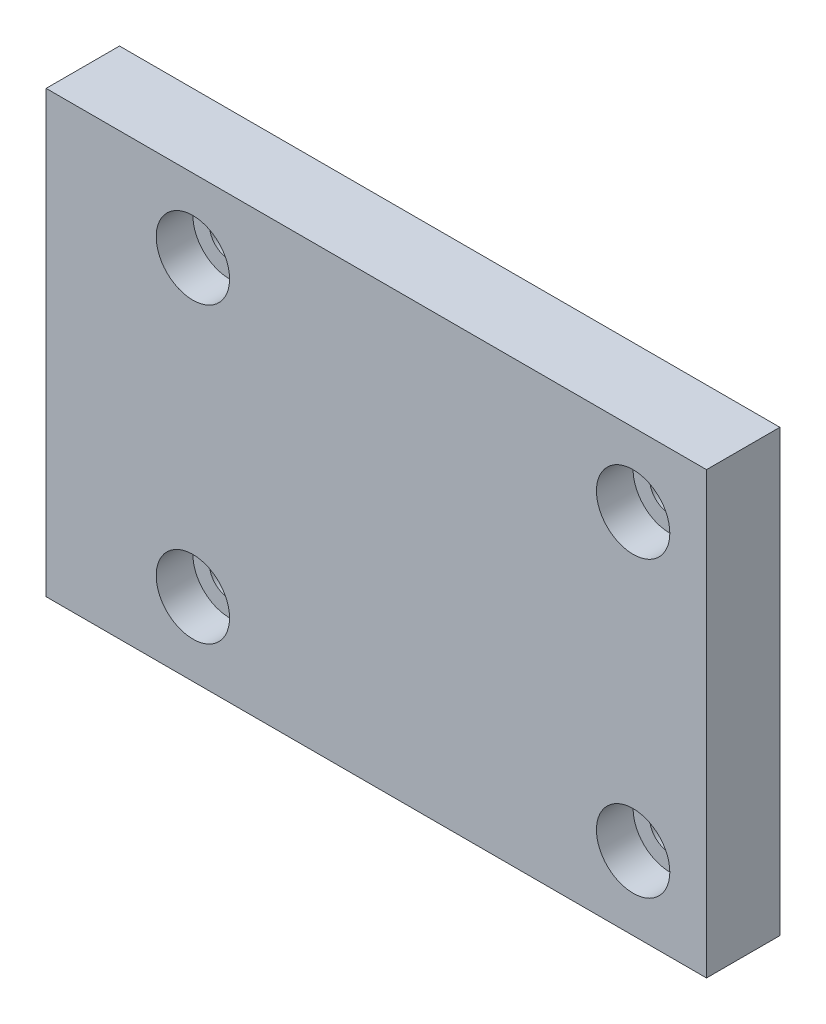
ISO-10303-21;
HEADER;
FILE_DESCRIPTION(('STEP AP214'),'2;1');
FILE_NAME('part.step','',(''),(''),'','','');
FILE_SCHEMA(('AUTOMOTIVE_DESIGN { 1 0 10303 214 1 1 1 1 }'));
ENDSEC;
DATA;
#1=APPLICATION_CONTEXT('core data for automotive mechanical design processes');
#2=APPLICATION_PROTOCOL_DEFINITION('international standard','automotive_design',2000,#1);
#3=PRODUCT_CONTEXT('',#1,'mechanical');
#4=PRODUCT('Part','Part','',(#3));
#5=PRODUCT_RELATED_PRODUCT_CATEGORY('part','',(#4));
#6=PRODUCT_DEFINITION_FORMATION('','',#4);
#7=PRODUCT_DEFINITION_CONTEXT('part definition',#1,'design');
#8=PRODUCT_DEFINITION('design','',#6,#7);
#9=PRODUCT_DEFINITION_SHAPE('','',#8);
#10=(LENGTH_UNIT() NAMED_UNIT(*) SI_UNIT(.MILLI.,.METRE.));
#11=(NAMED_UNIT(*) PLANE_ANGLE_UNIT() SI_UNIT($,.RADIAN.));
#12=(NAMED_UNIT(*) SI_UNIT($,.STERADIAN.) SOLID_ANGLE_UNIT());
#13=UNCERTAINTY_MEASURE_WITH_UNIT(LENGTH_MEASURE(1.E-05),#10,'distance_accuracy_value','');
#14=(GEOMETRIC_REPRESENTATION_CONTEXT(3) GLOBAL_UNCERTAINTY_ASSIGNED_CONTEXT((#13)) GLOBAL_UNIT_ASSIGNED_CONTEXT((#10,
#11,#12)) REPRESENTATION_CONTEXT('',''));
#15=CARTESIAN_POINT('',(0.,0.,0.));
#16=DIRECTION('',(0.,0.,1.));
#17=DIRECTION('',(1.,0.,0.));
#18=AXIS2_PLACEMENT_3D('',#15,#16,#17);
#19=CARTESIAN_POINT('',(35.,-20.,5.));
#20=DIRECTION('',(0.,0.,1.));
#21=DIRECTION('',(1.,0.,0.));
#22=AXIS2_PLACEMENT_3D('',#19,#20,#21);
#23=CYLINDRICAL_SURFACE('',#22,5.);
#24=CARTESIAN_POINT('',(35.,-20.,0.));
#25=DIRECTION('',(0.,0.,1.));
#26=DIRECTION('',(1.,0.,0.));
#27=AXIS2_PLACEMENT_3D('',#24,#25,#26);
#28=CIRCLE('',#27,5.);
#29=CARTESIAN_POINT('',(40.,-20.,0.));
#30=VERTEX_POINT('',#29);
#31=EDGE_CURVE('E11',#30,#30,#28,.T.);
#32=ORIENTED_EDGE('',*,*,#31,.F.);
#33=EDGE_LOOP('',(#32));
#34=FACE_BOUND('',#33,.T.);
#35=CARTESIAN_POINT('',(35.,-20.,5.));
#36=DIRECTION('',(0.,0.,1.));
#37=DIRECTION('',(1.,0.,0.));
#38=AXIS2_PLACEMENT_3D('',#35,#36,#37);
#39=CIRCLE('',#38,5.);
#40=CARTESIAN_POINT('',(40.,-20.,5.));
#41=VERTEX_POINT('',#40);
#42=EDGE_CURVE('E123',#41,#41,#39,.T.);
#43=ORIENTED_EDGE('',*,*,#42,.T.);
#44=EDGE_LOOP('',(#43));
#45=FACE_BOUND('',#44,.T.);
#46=ADVANCED_FACE('F33',(#34,#45),#23,.F.);
#47=CARTESIAN_POINT('',(37.75,-20.,0.));
#48=DIRECTION('',(0.,0.,-1.));
#49=DIRECTION('',(-1.,0.,0.));
#50=AXIS2_PLACEMENT_3D('',#47,#48,#49);
#51=PLANE('',#50);
#52=CARTESIAN_POINT('',(35.,-20.,0.));
#53=DIRECTION('',(0.,0.,1.));
#54=DIRECTION('',(1.,0.,0.));
#55=AXIS2_PLACEMENT_3D('',#52,#53,#54);
#56=CIRCLE('',#55,2.75);
#57=CARTESIAN_POINT('',(37.75,-20.,0.));
#58=VERTEX_POINT('',#57);
#59=EDGE_CURVE('E41',#58,#58,#56,.T.);
#60=ORIENTED_EDGE('',*,*,#59,.F.);
#61=EDGE_LOOP('',(#60));
#62=FACE_BOUND('',#61,.T.);
#63=ORIENTED_EDGE('',*,*,#31,.T.);
#64=EDGE_LOOP('',(#63));
#65=FACE_BOUND('',#64,.T.);
#66=ADVANCED_FACE('F133',(#62,#65),#51,.F.);
#67=CARTESIAN_POINT('',(35.,-20.,5.));
#68=DIRECTION('',(0.,0.,1.));
#69=DIRECTION('',(1.,0.,0.));
#70=AXIS2_PLACEMENT_3D('',#67,#68,#69);
#71=CYLINDRICAL_SURFACE('',#70,2.75);
#72=CARTESIAN_POINT('',(35.,-20.,-5.));
#73=DIRECTION('',(0.,0.,1.));
#74=DIRECTION('',(1.,0.,0.));
#75=AXIS2_PLACEMENT_3D('',#72,#73,#74);
#76=CIRCLE('',#75,2.75);
#77=CARTESIAN_POINT('',(37.75,-20.,-5.));
#78=VERTEX_POINT('',#77);
#79=EDGE_CURVE('E126',#78,#78,#76,.T.);
#80=ORIENTED_EDGE('',*,*,#79,.F.);
#81=EDGE_LOOP('',(#80));
#82=FACE_BOUND('',#81,.T.);
#83=ORIENTED_EDGE('',*,*,#59,.T.);
#84=EDGE_LOOP('',(#83));
#85=FACE_BOUND('',#84,.T.);
#86=ADVANCED_FACE('F131',(#82,#85),#71,.F.);
#87=CARTESIAN_POINT('',(-25.,-20.,5.));
#88=DIRECTION('',(0.,0.,1.));
#89=DIRECTION('',(1.,0.,0.));
#90=AXIS2_PLACEMENT_3D('',#87,#88,#89);
#91=CYLINDRICAL_SURFACE('',#90,5.);
#92=CARTESIAN_POINT('',(-25.,-20.,0.));
#93=DIRECTION('',(0.,0.,1.));
#94=DIRECTION('',(1.,0.,0.));
#95=AXIS2_PLACEMENT_3D('',#92,#93,#94);
#96=CIRCLE('',#95,5.);
#97=CARTESIAN_POINT('',(-20.,-20.,0.));
#98=VERTEX_POINT('',#97);
#99=EDGE_CURVE('E120',#98,#98,#96,.T.);
#100=ORIENTED_EDGE('',*,*,#99,.F.);
#101=EDGE_LOOP('',(#100));
#102=FACE_BOUND('',#101,.T.);
#103=CARTESIAN_POINT('',(-25.,-20.,5.));
#104=DIRECTION('',(0.,0.,1.));
#105=DIRECTION('',(1.,0.,0.));
#106=AXIS2_PLACEMENT_3D('',#103,#104,#105);
#107=CIRCLE('',#106,5.);
#108=CARTESIAN_POINT('',(-20.,-20.,5.));
#109=VERTEX_POINT('',#108);
#110=EDGE_CURVE('E111',#109,#109,#107,.T.);
#111=ORIENTED_EDGE('',*,*,#110,.T.);
#112=EDGE_LOOP('',(#111));
#113=FACE_BOUND('',#112,.T.);
#114=ADVANCED_FACE('F175',(#102,#113),#91,.F.);
#115=CARTESIAN_POINT('',(-22.25,-20.,0.));
#116=DIRECTION('',(0.,0.,-1.));
#117=DIRECTION('',(-1.,0.,0.));
#118=AXIS2_PLACEMENT_3D('',#115,#116,#117);
#119=PLANE('',#118);
#120=CARTESIAN_POINT('',(-25.,-20.,0.));
#121=DIRECTION('',(0.,0.,1.));
#122=DIRECTION('',(1.,0.,0.));
#123=AXIS2_PLACEMENT_3D('',#120,#121,#122);
#124=CIRCLE('',#123,2.75);
#125=CARTESIAN_POINT('',(-22.25,-20.,0.));
#126=VERTEX_POINT('',#125);
#127=EDGE_CURVE('E117',#126,#126,#124,.T.);
#128=ORIENTED_EDGE('',*,*,#127,.F.);
#129=EDGE_LOOP('',(#128));
#130=FACE_BOUND('',#129,.T.);
#131=ORIENTED_EDGE('',*,*,#99,.T.);
#132=EDGE_LOOP('',(#131));
#133=FACE_BOUND('',#132,.T.);
#134=ADVANCED_FACE('F171',(#130,#133),#119,.F.);
#135=CARTESIAN_POINT('',(-25.,-20.,5.));
#136=DIRECTION('',(0.,0.,1.));
#137=DIRECTION('',(1.,0.,0.));
#138=AXIS2_PLACEMENT_3D('',#135,#136,#137);
#139=CYLINDRICAL_SURFACE('',#138,2.75);
#140=CARTESIAN_POINT('',(-25.,-20.,-5.));
#141=DIRECTION('',(0.,0.,1.));
#142=DIRECTION('',(1.,0.,0.));
#143=AXIS2_PLACEMENT_3D('',#140,#141,#142);
#144=CIRCLE('',#143,2.75);
#145=CARTESIAN_POINT('',(-22.25,-20.,-5.));
#146=VERTEX_POINT('',#145);
#147=EDGE_CURVE('E114',#146,#146,#144,.T.);
#148=ORIENTED_EDGE('',*,*,#147,.F.);
#149=EDGE_LOOP('',(#148));
#150=FACE_BOUND('',#149,.T.);
#151=ORIENTED_EDGE('',*,*,#127,.T.);
#152=EDGE_LOOP('',(#151));
#153=FACE_BOUND('',#152,.T.);
#154=ADVANCED_FACE('F167',(#150,#153),#139,.F.);
#155=CARTESIAN_POINT('',(45.,-30.,5.));
#156=DIRECTION('',(-1.,0.,0.));
#157=DIRECTION('',(0.,0.,1.));
#158=AXIS2_PLACEMENT_3D('',#155,#156,#157);
#159=PLANE('',#158);
#160=DIRECTION('',(0.,1.,0.));
#161=VECTOR('',#160,1.);
#162=CARTESIAN_POINT('',(45.,-30.,-5.));
#163=LINE('',#162,#161);
#164=CARTESIAN_POINT('',(45.,-30.,-5.));
#165=VERTEX_POINT('',#164);
#166=CARTESIAN_POINT('',(45.,30.,-5.));
#167=VERTEX_POINT('',#166);
#168=EDGE_CURVE('E101',#165,#167,#163,.T.);
#169=ORIENTED_EDGE('',*,*,#168,.T.);
#170=DIRECTION('',(0.,0.,-1.));
#171=VECTOR('',#170,1.);
#172=CARTESIAN_POINT('',(45.,30.,5.));
#173=LINE('',#172,#171);
#174=CARTESIAN_POINT('',(45.,30.,5.));
#175=VERTEX_POINT('',#174);
#176=EDGE_CURVE('E92',#175,#167,#173,.T.);
#177=ORIENTED_EDGE('',*,*,#176,.F.);
#178=DIRECTION('',(0.,1.,0.));
#179=VECTOR('',#178,1.);
#180=CARTESIAN_POINT('',(45.,-30.,5.));
#181=LINE('',#180,#179);
#182=CARTESIAN_POINT('',(45.,-30.,5.));
#183=VERTEX_POINT('',#182);
#184=EDGE_CURVE('E86',#183,#175,#181,.T.);
#185=ORIENTED_EDGE('',*,*,#184,.F.);
#186=DIRECTION('',(0.,0.,-1.));
#187=VECTOR('',#186,1.);
#188=CARTESIAN_POINT('',(45.,-30.,5.));
#189=LINE('',#188,#187);
#190=EDGE_CURVE('E97',#183,#165,#189,.T.);
#191=ORIENTED_EDGE('',*,*,#190,.T.);
#192=EDGE_LOOP('',(#169,#177,#185,#191));
#193=FACE_BOUND('',#192,.T.);
#194=ADVANCED_FACE('F164',(#193),#159,.F.);
#195=CARTESIAN_POINT('',(-45.,30.,5.));
#196=DIRECTION('',(0.,-1.,0.));
#197=DIRECTION('',(0.,0.,-1.));
#198=AXIS2_PLACEMENT_3D('',#195,#196,#197);
#199=PLANE('',#198);
#200=DIRECTION('',(-1.,0.,0.));
#201=VECTOR('',#200,1.);
#202=CARTESIAN_POINT('',(-45.,30.,-5.));
#203=LINE('',#202,#201);
#204=CARTESIAN_POINT('',(-45.,30.,-5.));
#205=VERTEX_POINT('',#204);
#206=EDGE_CURVE('E91',#167,#205,#203,.T.);
#207=ORIENTED_EDGE('',*,*,#206,.T.);
#208=DIRECTION('',(0.,0.,-1.));
#209=VECTOR('',#208,1.);
#210=CARTESIAN_POINT('',(-45.,30.,5.));
#211=LINE('',#210,#209);
#212=CARTESIAN_POINT('',(-45.,30.,5.));
#213=VERTEX_POINT('',#212);
#214=EDGE_CURVE('E89',#213,#205,#211,.T.);
#215=ORIENTED_EDGE('',*,*,#214,.F.);
#216=DIRECTION('',(-1.,0.,0.));
#217=VECTOR('',#216,1.);
#218=CARTESIAN_POINT('',(-45.,30.,5.));
#219=LINE('',#218,#217);
#220=EDGE_CURVE('E80',#175,#213,#219,.T.);
#221=ORIENTED_EDGE('',*,*,#220,.F.);
#222=ORIENTED_EDGE('',*,*,#176,.T.);
#223=EDGE_LOOP('',(#207,#215,#221,#222));
#224=FACE_BOUND('',#223,.T.);
#225=ADVANCED_FACE('F90',(#224),#199,.F.);
#226=CARTESIAN_POINT('',(-45.,-30.,5.));
#227=DIRECTION('',(1.,0.,0.));
#228=DIRECTION('',(0.,0.,-1.));
#229=AXIS2_PLACEMENT_3D('',#226,#227,#228);
#230=PLANE('',#229);
#231=DIRECTION('',(0.,-1.,0.));
#232=VECTOR('',#231,1.);
#233=CARTESIAN_POINT('',(-45.,-30.,-5.));
#234=LINE('',#233,#232);
#235=CARTESIAN_POINT('',(-45.,-30.,-5.));
#236=VERTEX_POINT('',#235);
#237=EDGE_CURVE('E66',#205,#236,#234,.T.);
#238=ORIENTED_EDGE('',*,*,#237,.T.);
#239=DIRECTION('',(0.,0.,-1.));
#240=VECTOR('',#239,1.);
#241=CARTESIAN_POINT('',(-45.,-30.,5.));
#242=LINE('',#241,#240);
#243=CARTESIAN_POINT('',(-45.,-30.,5.));
#244=VERTEX_POINT('',#243);
#245=EDGE_CURVE('E93',#244,#236,#242,.T.);
#246=ORIENTED_EDGE('',*,*,#245,.F.);
#247=DIRECTION('',(0.,-1.,0.));
#248=VECTOR('',#247,1.);
#249=CARTESIAN_POINT('',(-45.,-30.,5.));
#250=LINE('',#249,#248);
#251=EDGE_CURVE('E84',#213,#244,#250,.T.);
#252=ORIENTED_EDGE('',*,*,#251,.F.);
#253=ORIENTED_EDGE('',*,*,#214,.T.);
#254=EDGE_LOOP('',(#238,#246,#252,#253));
#255=FACE_BOUND('',#254,.T.);
#256=ADVANCED_FACE('F95',(#255),#230,.F.);
#257=CARTESIAN_POINT('',(-45.,-30.,5.));
#258=DIRECTION('',(0.,1.,0.));
#259=DIRECTION('',(0.,0.,1.));
#260=AXIS2_PLACEMENT_3D('',#257,#258,#259);
#261=PLANE('',#260);
#262=DIRECTION('',(1.,0.,0.));
#263=VECTOR('',#262,1.);
#264=CARTESIAN_POINT('',(-45.,-30.,-5.));
#265=LINE('',#264,#263);
#266=EDGE_CURVE('E72',#236,#165,#265,.T.);
#267=ORIENTED_EDGE('',*,*,#266,.T.);
#268=ORIENTED_EDGE('',*,*,#190,.F.);
#269=DIRECTION('',(1.,0.,0.));
#270=VECTOR('',#269,1.);
#271=CARTESIAN_POINT('',(-45.,-30.,5.));
#272=LINE('',#271,#270);
#273=EDGE_CURVE('E49',#244,#183,#272,.T.);
#274=ORIENTED_EDGE('',*,*,#273,.F.);
#275=ORIENTED_EDGE('',*,*,#245,.T.);
#276=EDGE_LOOP('',(#267,#268,#274,#275));
#277=FACE_BOUND('',#276,.T.);
#278=ADVANCED_FACE('F144',(#277),#261,.F.);
#279=CARTESIAN_POINT('',(0.,0.,5.));
#280=DIRECTION('',(0.,0.,-1.));
#281=DIRECTION('',(-1.,0.,0.));
#282=AXIS2_PLACEMENT_3D('',#279,#280,#281);
#283=PLANE('',#282);
#284=CARTESIAN_POINT('',(35.,20.,5.));
#285=DIRECTION('',(0.,0.,1.));
#286=DIRECTION('',(1.,0.,0.));
#287=AXIS2_PLACEMENT_3D('',#284,#285,#286);
#288=CIRCLE('',#287,5.);
#289=CARTESIAN_POINT('',(40.,20.,5.));
#290=VERTEX_POINT('',#289);
#291=EDGE_CURVE('E303',#290,#290,#288,.T.);
#292=ORIENTED_EDGE('',*,*,#291,.F.);
#293=EDGE_LOOP('',(#292));
#294=FACE_BOUND('',#293,.T.);
#295=CARTESIAN_POINT('',(-25.,20.,5.));
#296=DIRECTION('',(0.,0.,1.));
#297=DIRECTION('',(1.,0.,0.));
#298=AXIS2_PLACEMENT_3D('',#295,#296,#297);
#299=CIRCLE('',#298,5.);
#300=CARTESIAN_POINT('',(-20.,20.,5.));
#301=VERTEX_POINT('',#300);
#302=EDGE_CURVE('E313',#301,#301,#299,.T.);
#303=ORIENTED_EDGE('',*,*,#302,.F.);
#304=EDGE_LOOP('',(#303));
#305=FACE_BOUND('',#304,.T.);
#306=ORIENTED_EDGE('',*,*,#184,.T.);
#307=ORIENTED_EDGE('',*,*,#220,.T.);
#308=ORIENTED_EDGE('',*,*,#251,.T.);
#309=ORIENTED_EDGE('',*,*,#273,.T.);
#310=EDGE_LOOP('',(#306,#307,#308,#309));
#311=FACE_BOUND('',#310,.T.);
#312=ORIENTED_EDGE('',*,*,#110,.F.);
#313=EDGE_LOOP('',(#312));
#314=FACE_BOUND('',#313,.T.);
#315=ORIENTED_EDGE('',*,*,#42,.F.);
#316=EDGE_LOOP('',(#315));
#317=FACE_BOUND('',#316,.T.);
#318=ADVANCED_FACE('F81',(#294,#305,#311,#314,#317),#283,.F.);
#319=CARTESIAN_POINT('',(0.,0.,-5.));
#320=DIRECTION('',(0.,0.,-1.));
#321=DIRECTION('',(-1.,0.,0.));
#322=AXIS2_PLACEMENT_3D('',#319,#320,#321);
#323=PLANE('',#322);
#324=CARTESIAN_POINT('',(35.,20.,-5.));
#325=DIRECTION('',(0.,0.,1.));
#326=DIRECTION('',(1.,0.,0.));
#327=AXIS2_PLACEMENT_3D('',#324,#325,#326);
#328=CIRCLE('',#327,2.75);
#329=CARTESIAN_POINT('',(37.75,20.,-5.));
#330=VERTEX_POINT('',#329);
#331=EDGE_CURVE('E304',#330,#330,#328,.T.);
#332=ORIENTED_EDGE('',*,*,#331,.T.);
#333=EDGE_LOOP('',(#332));
#334=FACE_BOUND('',#333,.T.);
#335=CARTESIAN_POINT('',(-25.,20.,-5.));
#336=DIRECTION('',(0.,0.,1.));
#337=DIRECTION('',(1.,0.,0.));
#338=AXIS2_PLACEMENT_3D('',#335,#336,#337);
#339=CIRCLE('',#338,2.75);
#340=CARTESIAN_POINT('',(-22.25,20.,-5.));
#341=VERTEX_POINT('',#340);
#342=EDGE_CURVE('E104',#341,#341,#339,.T.);
#343=ORIENTED_EDGE('',*,*,#342,.T.);
#344=EDGE_LOOP('',(#343));
#345=FACE_BOUND('',#344,.T.);
#346=ORIENTED_EDGE('',*,*,#168,.F.);
#347=ORIENTED_EDGE('',*,*,#266,.F.);
#348=ORIENTED_EDGE('',*,*,#237,.F.);
#349=ORIENTED_EDGE('',*,*,#206,.F.);
#350=EDGE_LOOP('',(#346,#347,#348,#349));
#351=FACE_BOUND('',#350,.T.);
#352=ORIENTED_EDGE('',*,*,#147,.T.);
#353=EDGE_LOOP('',(#352));
#354=FACE_BOUND('',#353,.T.);
#355=ORIENTED_EDGE('',*,*,#79,.T.);
#356=EDGE_LOOP('',(#355));
#357=FACE_BOUND('',#356,.T.);
#358=ADVANCED_FACE('F143',(#334,#345,#351,#354,#357),#323,.T.);
#359=CARTESIAN_POINT('',(-25.,20.,5.));
#360=DIRECTION('',(0.,0.,1.));
#361=DIRECTION('',(1.,0.,0.));
#362=AXIS2_PLACEMENT_3D('',#359,#360,#361);
#363=CYLINDRICAL_SURFACE('',#362,2.75);
#364=ORIENTED_EDGE('',*,*,#342,.F.);
#365=EDGE_LOOP('',(#364));
#366=FACE_BOUND('',#365,.T.);
#367=CARTESIAN_POINT('',(-25.,20.,0.));
#368=DIRECTION('',(0.,0.,1.));
#369=DIRECTION('',(1.,0.,0.));
#370=AXIS2_PLACEMENT_3D('',#367,#368,#369);
#371=CIRCLE('',#370,2.75);
#372=CARTESIAN_POINT('',(-22.25,20.,0.));
#373=VERTEX_POINT('',#372);
#374=EDGE_CURVE('E319',#373,#373,#371,.T.);
#375=ORIENTED_EDGE('',*,*,#374,.T.);
#376=EDGE_LOOP('',(#375));
#377=FACE_BOUND('',#376,.T.);
#378=ADVANCED_FACE('F151',(#366,#377),#363,.F.);
#379=CARTESIAN_POINT('',(-22.25,20.,0.));
#380=DIRECTION('',(0.,0.,-1.));
#381=DIRECTION('',(-1.,0.,0.));
#382=AXIS2_PLACEMENT_3D('',#379,#380,#381);
#383=PLANE('',#382);
#384=ORIENTED_EDGE('',*,*,#374,.F.);
#385=EDGE_LOOP('',(#384));
#386=FACE_BOUND('',#385,.T.);
#387=CARTESIAN_POINT('',(-25.,20.,0.));
#388=DIRECTION('',(0.,0.,1.));
#389=DIRECTION('',(1.,0.,0.));
#390=AXIS2_PLACEMENT_3D('',#387,#388,#389);
#391=CIRCLE('',#390,5.);
#392=CARTESIAN_POINT('',(-20.,20.,0.));
#393=VERTEX_POINT('',#392);
#394=EDGE_CURVE('E316',#393,#393,#391,.T.);
#395=ORIENTED_EDGE('',*,*,#394,.T.);
#396=EDGE_LOOP('',(#395));
#397=FACE_BOUND('',#396,.T.);
#398=ADVANCED_FACE('F226',(#386,#397),#383,.F.);
#399=CARTESIAN_POINT('',(-25.,20.,5.));
#400=DIRECTION('',(0.,0.,1.));
#401=DIRECTION('',(1.,0.,0.));
#402=AXIS2_PLACEMENT_3D('',#399,#400,#401);
#403=CYLINDRICAL_SURFACE('',#402,5.);
#404=ORIENTED_EDGE('',*,*,#394,.F.);
#405=EDGE_LOOP('',(#404));
#406=FACE_BOUND('',#405,.T.);
#407=ORIENTED_EDGE('',*,*,#302,.T.);
#408=EDGE_LOOP('',(#407));
#409=FACE_BOUND('',#408,.T.);
#410=ADVANCED_FACE('F236',(#406,#409),#403,.F.);
#411=CARTESIAN_POINT('',(35.,20.,5.));
#412=DIRECTION('',(0.,0.,1.));
#413=DIRECTION('',(1.,0.,0.));
#414=AXIS2_PLACEMENT_3D('',#411,#412,#413);
#415=CYLINDRICAL_SURFACE('',#414,2.75);
#416=ORIENTED_EDGE('',*,*,#331,.F.);
#417=EDGE_LOOP('',(#416));
#418=FACE_BOUND('',#417,.T.);
#419=CARTESIAN_POINT('',(35.,20.,0.));
#420=DIRECTION('',(0.,0.,1.));
#421=DIRECTION('',(1.,0.,0.));
#422=AXIS2_PLACEMENT_3D('',#419,#420,#421);
#423=CIRCLE('',#422,2.75);
#424=CARTESIAN_POINT('',(37.75,20.,0.));
#425=VERTEX_POINT('',#424);
#426=EDGE_CURVE('E310',#425,#425,#423,.T.);
#427=ORIENTED_EDGE('',*,*,#426,.T.);
#428=EDGE_LOOP('',(#427));
#429=FACE_BOUND('',#428,.T.);
#430=ADVANCED_FACE('F245',(#418,#429),#415,.F.);
#431=CARTESIAN_POINT('',(37.75,20.,0.));
#432=DIRECTION('',(0.,0.,-1.));
#433=DIRECTION('',(-1.,0.,0.));
#434=AXIS2_PLACEMENT_3D('',#431,#432,#433);
#435=PLANE('',#434);
#436=ORIENTED_EDGE('',*,*,#426,.F.);
#437=EDGE_LOOP('',(#436));
#438=FACE_BOUND('',#437,.T.);
#439=CARTESIAN_POINT('',(35.,20.,0.));
#440=DIRECTION('',(0.,0.,1.));
#441=DIRECTION('',(1.,0.,0.));
#442=AXIS2_PLACEMENT_3D('',#439,#440,#441);
#443=CIRCLE('',#442,5.);
#444=CARTESIAN_POINT('',(40.,20.,0.));
#445=VERTEX_POINT('',#444);
#446=EDGE_CURVE('E301',#445,#445,#443,.T.);
#447=ORIENTED_EDGE('',*,*,#446,.T.);
#448=EDGE_LOOP('',(#447));
#449=FACE_BOUND('',#448,.T.);
#450=ADVANCED_FACE('F274',(#438,#449),#435,.F.);
#451=CARTESIAN_POINT('',(35.,20.,5.));
#452=DIRECTION('',(0.,0.,1.));
#453=DIRECTION('',(1.,0.,0.));
#454=AXIS2_PLACEMENT_3D('',#451,#452,#453);
#455=CYLINDRICAL_SURFACE('',#454,5.);
#456=ORIENTED_EDGE('',*,*,#446,.F.);
#457=EDGE_LOOP('',(#456));
#458=FACE_BOUND('',#457,.T.);
#459=ORIENTED_EDGE('',*,*,#291,.T.);
#460=EDGE_LOOP('',(#459));
#461=FACE_BOUND('',#460,.T.);
#462=ADVANCED_FACE('F284',(#458,#461),#455,.F.);
#463=CLOSED_SHELL('',(#46,#66,#86,#114,#134,#154,#194,#225,#256,#278,#318,#358,#378,#398,#410,
#430,#450,#462));
#464=MANIFOLD_SOLID_BREP('B2',#463);
#465=ADVANCED_BREP_SHAPE_REPRESENTATION('',(#18,#464),#14);
#466=SHAPE_DEFINITION_REPRESENTATION(#9,#465);
ENDSEC;
END-ISO-10303-21;
